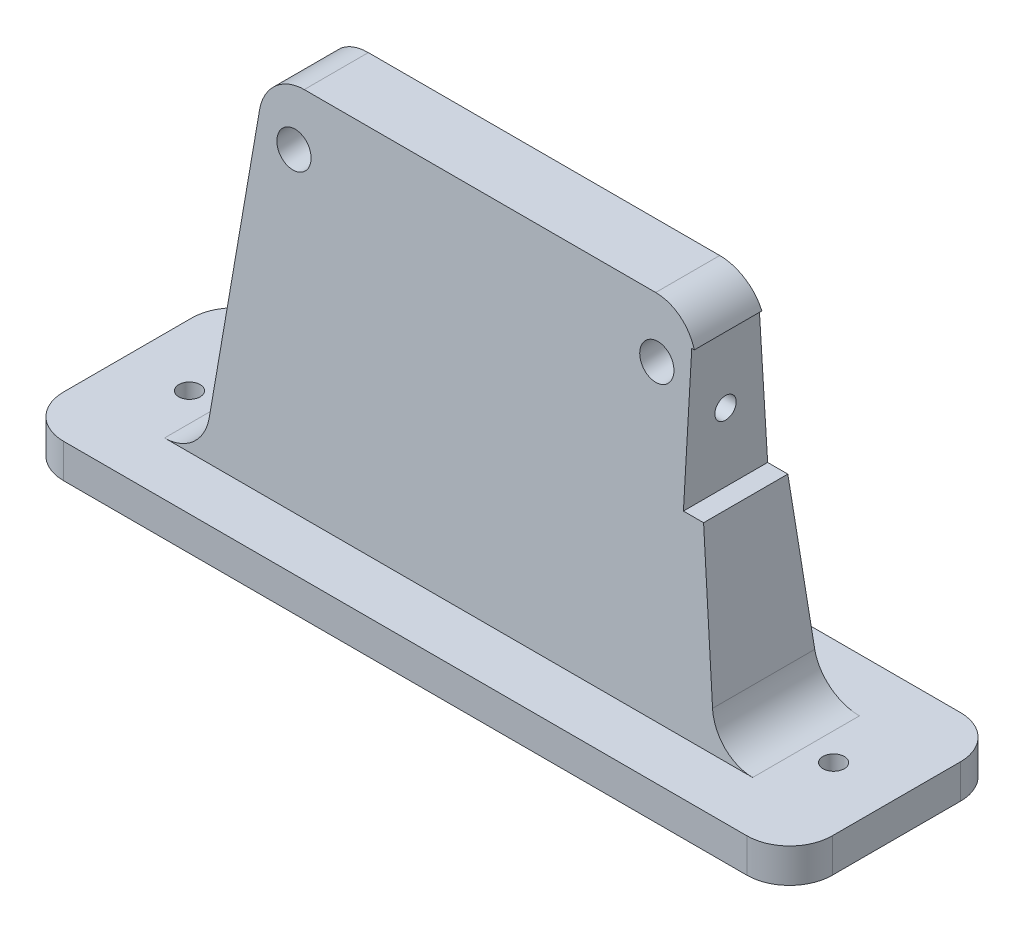
ISO-10303-21;
HEADER;
FILE_DESCRIPTION(('STEP AP214'),'2;1');
FILE_NAME('part.step','',(''),(''),'','','');
FILE_SCHEMA(('AUTOMOTIVE_DESIGN { 1 0 10303 214 1 1 1 1 }'));
ENDSEC;
DATA;
#1=APPLICATION_CONTEXT('core data for automotive mechanical design processes');
#2=APPLICATION_PROTOCOL_DEFINITION('international standard','automotive_design',2000,#1);
#3=PRODUCT_CONTEXT('',#1,'mechanical');
#4=PRODUCT('Part','Part','',(#3));
#5=PRODUCT_RELATED_PRODUCT_CATEGORY('part','',(#4));
#6=PRODUCT_DEFINITION_FORMATION('','',#4);
#7=PRODUCT_DEFINITION_CONTEXT('part definition',#1,'design');
#8=PRODUCT_DEFINITION('design','',#6,#7);
#9=PRODUCT_DEFINITION_SHAPE('','',#8);
#10=(LENGTH_UNIT() NAMED_UNIT(*) SI_UNIT(.MILLI.,.METRE.));
#11=(NAMED_UNIT(*) PLANE_ANGLE_UNIT() SI_UNIT($,.RADIAN.));
#12=(NAMED_UNIT(*) SI_UNIT($,.STERADIAN.) SOLID_ANGLE_UNIT());
#13=UNCERTAINTY_MEASURE_WITH_UNIT(LENGTH_MEASURE(1.E-05),#10,'distance_accuracy_value','');
#14=(GEOMETRIC_REPRESENTATION_CONTEXT(3) GLOBAL_UNCERTAINTY_ASSIGNED_CONTEXT((#13)) GLOBAL_UNIT_ASSIGNED_CONTEXT((#10,
#11,#12)) REPRESENTATION_CONTEXT('',''));
#15=CARTESIAN_POINT('',(0.,0.,0.));
#16=DIRECTION('',(0.,0.,1.));
#17=DIRECTION('',(1.,0.,0.));
#18=AXIS2_PLACEMENT_3D('',#15,#16,#17);
#19=CARTESIAN_POINT('',(-68.854573867348,18.,0.));
#20=DIRECTION('',(0.,0.,-1.));
#21=DIRECTION('',(-1.,0.,0.));
#22=AXIS2_PLACEMENT_3D('',#19,#20,#21);
#23=CYLINDRICAL_SURFACE('',#22,10.);
#24=DIRECTION('',(0.,0.,1.));
#25=VECTOR('',#24,1.);
#26=CARTESIAN_POINT('',(-58.9281150918427,16.7894562468896,0.));
#27=LINE('',#26,#25);
#28=CARTESIAN_POINT('',(-58.9281150918427,16.7894562468896,-11.9640575459214));
#29=VERTEX_POINT('',#28);
#30=CARTESIAN_POINT('',(-58.9281150918427,16.7894562468896,11.9640575459214));
#31=VERTEX_POINT('',#30);
#32=EDGE_CURVE('E361',#29,#31,#27,.T.);
#33=ORIENTED_EDGE('',*,*,#32,.F.);
#34=CARTESIAN_POINT('',(-68.854573867348,18.,-11.890243902439));
#35=DIRECTION('',(0.,-0.0608625704505583,0.998146155389155));
#36=DIRECTION('',(0.,-0.998146155389155,-0.0608625704505583));
#37=AXIS2_PLACEMENT_3D('',#34,#35,#36);
#38=ELLIPSE('',#37,10.018572877337,10.);
#39=CARTESIAN_POINT('',(-68.854573867348,8.,-12.5));
#40=VERTEX_POINT('',#39);
#41=EDGE_CURVE('E60',#29,#40,#38,.F.);
#42=ORIENTED_EDGE('',*,*,#41,.T.);
#43=DIRECTION('',(0.,0.,1.));
#44=VECTOR('',#43,1.);
#45=CARTESIAN_POINT('',(-68.854573867348,8.,0.));
#46=LINE('',#45,#44);
#47=CARTESIAN_POINT('',(-68.854573867348,8.,12.5));
#48=VERTEX_POINT('',#47);
#49=EDGE_CURVE('E498',#48,#40,#46,.F.);
#50=ORIENTED_EDGE('',*,*,#49,.F.);
#51=CARTESIAN_POINT('',(-68.854573867348,18.,11.890243902439));
#52=DIRECTION('',(0.,-0.0608625704505584,-0.998146155389155));
#53=DIRECTION('',(0.,0.998146155389155,-0.0608625704505584));
#54=AXIS2_PLACEMENT_3D('',#51,#52,#53);
#55=ELLIPSE('',#54,10.018572877337,10.);
#56=EDGE_CURVE('E12',#48,#31,#55,.F.);
#57=ORIENTED_EDGE('',*,*,#56,.T.);
#58=EDGE_LOOP('',(#33,#42,#50,#57));
#59=FACE_BOUND('',#58,.T.);
#60=ADVANCED_FACE('F52',(#59),#23,.F.);
#61=CARTESIAN_POINT('',(68.854573867348,18.,0.));
#62=DIRECTION('',(0.,0.,1.));
#63=DIRECTION('',(1.,0.,0.));
#64=AXIS2_PLACEMENT_3D('',#61,#62,#63);
#65=CYLINDRICAL_SURFACE('',#64,10.);
#66=DIRECTION('',(0.,0.,-1.));
#67=VECTOR('',#66,1.);
#68=CARTESIAN_POINT('',(58.9281150918427,16.7894562468896,0.));
#69=LINE('',#68,#67);
#70=CARTESIAN_POINT('',(58.9281150918427,16.7894562468896,11.9640575459214));
#71=VERTEX_POINT('',#70);
#72=CARTESIAN_POINT('',(58.9281150918427,16.7894562468896,-11.9640575459214));
#73=VERTEX_POINT('',#72);
#74=EDGE_CURVE('E215',#71,#73,#69,.T.);
#75=ORIENTED_EDGE('',*,*,#74,.F.);
#76=CARTESIAN_POINT('',(68.854573867348,18.,11.890243902439));
#77=DIRECTION('',(0.,-0.0608625704505584,-0.998146155389155));
#78=DIRECTION('',(0.,-0.998146155389155,0.0608625704505584));
#79=AXIS2_PLACEMENT_3D('',#76,#77,#78);
#80=ELLIPSE('',#79,10.018572877337,10.);
#81=CARTESIAN_POINT('',(68.854573867348,8.,12.5));
#82=VERTEX_POINT('',#81);
#83=EDGE_CURVE('E354',#71,#82,#80,.F.);
#84=ORIENTED_EDGE('',*,*,#83,.T.);
#85=DIRECTION('',(0.,0.,-1.));
#86=VECTOR('',#85,1.);
#87=CARTESIAN_POINT('',(68.854573867348,8.,0.));
#88=LINE('',#87,#86);
#89=CARTESIAN_POINT('',(68.854573867348,8.,-12.5));
#90=VERTEX_POINT('',#89);
#91=EDGE_CURVE('E351',#90,#82,#88,.F.);
#92=ORIENTED_EDGE('',*,*,#91,.F.);
#93=CARTESIAN_POINT('',(68.854573867348,18.,-11.890243902439));
#94=DIRECTION('',(0.,-0.0608625704505583,0.998146155389155));
#95=DIRECTION('',(0.,0.998146155389155,0.0608625704505583));
#96=AXIS2_PLACEMENT_3D('',#93,#94,#95);
#97=ELLIPSE('',#96,10.018572877337,10.);
#98=EDGE_CURVE('E358',#90,#73,#97,.F.);
#99=ORIENTED_EDGE('',*,*,#98,.T.);
#100=EDGE_LOOP('',(#75,#84,#92,#99));
#101=FACE_BOUND('',#100,.T.);
#102=ADVANCED_FACE('F569',(#101),#65,.F.);
#103=CARTESIAN_POINT('',(60.0820633059789,7.32708089097302,0.));
#104=DIRECTION('',(-0.992645877550526,-0.121054375311039,0.));
#105=DIRECTION('',(0.121054375311039,-0.992645877550526,0.));
#106=AXIS2_PLACEMENT_3D('',#103,#104,#105);
#107=PLANE('',#106);
#108=DIRECTION('',(-0.120833238932402,0.990832559245699,-0.0604166194662013));
#109=VECTOR('',#108,1.);
#110=CARTESIAN_POINT('',(60.,8.,12.5));
#111=LINE('',#110,#109);
#112=CARTESIAN_POINT('',(54.7219524509109,51.2799899025308,9.86097622545543));
#113=VERTEX_POINT('',#112);
#114=EDGE_CURVE('E227',#71,#113,#111,.T.);
#115=ORIENTED_EDGE('',*,*,#114,.F.);
#116=ORIENTED_EDGE('',*,*,#74,.T.);
#117=DIRECTION('',(-0.120833238932402,0.990832559245699,0.0604166194662011));
#118=VECTOR('',#117,1.);
#119=CARTESIAN_POINT('',(60.,8.,-12.5));
#120=LINE('',#119,#118);
#121=CARTESIAN_POINT('',(54.7219524509109,51.2799899025308,-9.86097622545545));
#122=VERTEX_POINT('',#121);
#123=EDGE_CURVE('E343',#73,#122,#120,.T.);
#124=ORIENTED_EDGE('',*,*,#123,.T.);
#125=DIRECTION('',(0.,0.,-1.));
#126=VECTOR('',#125,1.);
#127=CARTESIAN_POINT('',(54.7219524509109,51.2799899025308,0.));
#128=LINE('',#127,#126);
#129=EDGE_CURVE('E468',#113,#122,#128,.T.);
#130=ORIENTED_EDGE('',*,*,#129,.F.);
#131=EDGE_LOOP('',(#115,#116,#124,#130));
#132=FACE_BOUND('',#131,.T.);
#133=ADVANCED_FACE('F389',(#132),#107,.F.);
#134=CARTESIAN_POINT('',(41.145426132652,80.,0.));
#135=DIRECTION('',(0.,0.,-1.));
#136=DIRECTION('',(-1.,0.,0.));
#137=AXIS2_PLACEMENT_3D('',#134,#135,#136);
#138=CYLINDRICAL_SURFACE('',#137,10.);
#139=CARTESIAN_POINT('',(41.145426132652,80.,8.10975609756097));
#140=DIRECTION('',(0.,-0.0608625704505584,-0.998146155389155));
#141=DIRECTION('',(0.,0.998146155389155,-0.0608625704505584));
#142=AXIS2_PLACEMENT_3D('',#139,#140,#141);
#143=ELLIPSE('',#142,10.018572877337,10.);
#144=CARTESIAN_POINT('',(50.5921998549606,83.2800100974692,7.90975548186163));
#145=VERTEX_POINT('',#144);
#146=CARTESIAN_POINT('',(41.145426132652,90.,7.49999999999999));
#147=VERTEX_POINT('',#146);
#148=EDGE_CURVE('E222',#145,#147,#143,.F.);
#149=ORIENTED_EDGE('',*,*,#148,.F.);
#150=DIRECTION('',(0.,0.,-1.));
#151=VECTOR('',#150,1.);
#152=CARTESIAN_POINT('',(50.5921998549606,83.2800100974692,0.));
#153=LINE('',#152,#151);
#154=CARTESIAN_POINT('',(50.5921998549606,83.2800100974692,-7.90975548186164));
#155=VERTEX_POINT('',#154);
#156=EDGE_CURVE('E463',#145,#155,#153,.T.);
#157=ORIENTED_EDGE('',*,*,#156,.T.);
#158=CARTESIAN_POINT('',(41.145426132652,80.,-8.10975609756098));
#159=DIRECTION('',(0.,-0.0608625704505583,0.998146155389155));
#160=DIRECTION('',(0.,-0.998146155389155,-0.0608625704505583));
#161=AXIS2_PLACEMENT_3D('',#158,#159,#160);
#162=ELLIPSE('',#161,10.018572877337,10.);
#163=CARTESIAN_POINT('',(41.145426132652,90.,-7.50000000000001));
#164=VERTEX_POINT('',#163);
#165=EDGE_CURVE('E208',#164,#155,#162,.F.);
#166=ORIENTED_EDGE('',*,*,#165,.F.);
#167=DIRECTION('',(0.,0.,-1.));
#168=VECTOR('',#167,1.);
#169=CARTESIAN_POINT('',(41.145426132652,90.,0.));
#170=LINE('',#169,#168);
#171=EDGE_CURVE('E226',#147,#164,#170,.T.);
#172=ORIENTED_EDGE('',*,*,#171,.F.);
#173=EDGE_LOOP('',(#149,#157,#166,#172));
#174=FACE_BOUND('',#173,.T.);
#175=ADVANCED_FACE('F462',(#174),#138,.T.);
#176=CARTESIAN_POINT('',(0.,0.789005778633874,12.9396947695955));
#177=DIRECTION('',(0.,-0.0608625704505584,-0.998146155389155));
#178=DIRECTION('',(0.,0.998146155389155,-0.0608625704505584));
#179=AXIS2_PLACEMENT_3D('',#176,#177,#178);
#180=PLANE('',#179);
#181=CARTESIAN_POINT('',(42.2141626200467,76.8616492298102,8.30111894940183));
#182=DIRECTION('',(0.,-0.0608625704505584,-0.998146155389155));
#183=DIRECTION('',(0.,0.998146155389155,-0.0608625704505584));
#184=AXIS2_PLACEMENT_3D('',#181,#182,#183);
#185=ELLIPSE('',#184,4.029855202269,4.00000000000001);
#186=CARTESIAN_POINT('',(42.2141626200467,80.88403370673,8.05585160324818));
#187=VERTEX_POINT('',#186);
#188=EDGE_CURVE('E335',#187,#187,#185,.T.);
#189=ORIENTED_EDGE('',*,*,#188,.T.);
#190=EDGE_LOOP('',(#189));
#191=FACE_BOUND('',#190,.T.);
#192=CARTESIAN_POINT('',(-42.7841008219345,77.4080238027561,8.26780342666122));
#193=DIRECTION('',(0.,-0.0608625704505584,-0.998146155389155));
#194=DIRECTION('',(0.,0.998146155389155,-0.0608625704505584));
#195=AXIS2_PLACEMENT_3D('',#192,#193,#194);
#196=ELLIPSE('',#195,4.029855202269,4.00000000000001);
#197=CARTESIAN_POINT('',(-42.7841008219345,81.4304082796759,8.02253608050758));
#198=VERTEX_POINT('',#197);
#199=EDGE_CURVE('E327',#198,#198,#196,.T.);
#200=ORIENTED_EDGE('',*,*,#199,.T.);
#201=EDGE_LOOP('',(#200));
#202=FACE_BOUND('',#201,.T.);
#203=DIRECTION('',(1.,0.,0.));
#204=VECTOR('',#203,1.);
#205=CARTESIAN_POINT('',(0.,51.2799899025308,9.86097622545545));
#206=LINE('',#205,#204);
#207=CARTESIAN_POINT('',(50.,51.2799899025308,9.86097622545544));
#208=VERTEX_POINT('',#207);
#209=EDGE_CURVE('E475',#208,#113,#206,.T.);
#210=ORIENTED_EDGE('',*,*,#209,.F.);
#211=DIRECTION('',(0.,0.998146155389155,-0.0608625704505584));
#212=VECTOR('',#211,1.);
#213=CARTESIAN_POINT('',(50.,0.789005778633874,12.9396947695955));
#214=LINE('',#213,#212);
#215=CARTESIAN_POINT('',(50.,83.2800100974692,7.90975548186163));
#216=VERTEX_POINT('',#215);
#217=EDGE_CURVE('E194',#208,#216,#214,.T.);
#218=ORIENTED_EDGE('',*,*,#217,.T.);
#219=DIRECTION('',(-1.,0.,0.));
#220=VECTOR('',#219,1.);
#221=CARTESIAN_POINT('',(0.,83.2800100974692,7.90975548186163));
#222=LINE('',#221,#220);
#223=EDGE_CURVE('E202',#145,#216,#222,.T.);
#224=ORIENTED_EDGE('',*,*,#223,.F.);
#225=ORIENTED_EDGE('',*,*,#148,.T.);
#226=DIRECTION('',(1.,0.,0.));
#227=VECTOR('',#226,1.);
#228=CARTESIAN_POINT('',(50.,90.,7.49999999999999));
#229=LINE('',#228,#227);
#230=CARTESIAN_POINT('',(-41.145426132652,90.,7.50000000000001));
#231=VERTEX_POINT('',#230);
#232=EDGE_CURVE('E424',#231,#147,#229,.T.);
#233=ORIENTED_EDGE('',*,*,#232,.F.);
#234=CARTESIAN_POINT('',(-41.145426132652,80.,8.10975609756098));
#235=DIRECTION('',(0.,-0.0608625704505584,-0.998146155389155));
#236=DIRECTION('',(0.,-0.998146155389155,0.0608625704505584));
#237=AXIS2_PLACEMENT_3D('',#234,#235,#236);
#238=ELLIPSE('',#237,10.018572877337,10.);
#239=CARTESIAN_POINT('',(-51.0718849081573,81.2105437531104,8.03594245407864));
#240=VERTEX_POINT('',#239);
#241=EDGE_CURVE('E444',#231,#240,#238,.F.);
#242=ORIENTED_EDGE('',*,*,#241,.T.);
#243=DIRECTION('',(0.120833238932402,0.990832559245699,-0.0604166194662011));
#244=VECTOR('',#243,1.);
#245=CARTESIAN_POINT('',(-60.,8.,12.5));
#246=LINE('',#245,#244);
#247=EDGE_CURVE('E347',#31,#240,#246,.T.);
#248=ORIENTED_EDGE('',*,*,#247,.F.);
#249=ORIENTED_EDGE('',*,*,#56,.F.);
#250=DIRECTION('',(1.,0.,0.));
#251=VECTOR('',#250,1.);
#252=CARTESIAN_POINT('',(60.,8.,12.5));
#253=LINE('',#252,#251);
#254=EDGE_CURVE('E75',#48,#82,#253,.T.);
#255=ORIENTED_EDGE('',*,*,#254,.T.);
#256=ORIENTED_EDGE('',*,*,#83,.F.);
#257=ORIENTED_EDGE('',*,*,#114,.T.);
#258=EDGE_LOOP('',(#210,#218,#224,#225,#233,#242,#248,#249,#255,#256,#257));
#259=FACE_BOUND('',#258,.T.);
#260=ADVANCED_FACE('F387',(#191,#202,#259),#180,.F.);
#261=CARTESIAN_POINT('',(0.,0.789005778633874,-12.9396947695955));
#262=DIRECTION('',(0.,-0.0608625704505583,0.998146155389155));
#263=DIRECTION('',(0.,-0.998146155389155,-0.0608625704505583));
#264=AXIS2_PLACEMENT_3D('',#261,#262,#263);
#265=PLANE('',#264);
#266=CARTESIAN_POINT('',(42.2141626200467,77.8702308772408,-8.23962006846094));
#267=DIRECTION('',(0.,0.0608625704505583,-0.998146155389155));
#268=DIRECTION('',(0.,0.998146155389155,0.0608625704505583));
#269=AXIS2_PLACEMENT_3D('',#266,#267,#268);
#270=CIRCLE('',#269,4.00000000000001);
#271=CARTESIAN_POINT('',(42.2141626200467,81.8628154987975,-7.9961697866587));
#272=VERTEX_POINT('',#271);
#273=EDGE_CURVE('E331',#272,#272,#270,.T.);
#274=ORIENTED_EDGE('',*,*,#273,.F.);
#275=EDGE_LOOP('',(#274));
#276=FACE_BOUND('',#275,.T.);
#277=CARTESIAN_POINT('',(-42.7841008219345,78.412557631451,-8.20655136393591));
#278=DIRECTION('',(0.,0.0608625704505583,-0.998146155389155));
#279=DIRECTION('',(0.,0.998146155389155,0.0608625704505583));
#280=AXIS2_PLACEMENT_3D('',#277,#278,#279);
#281=CIRCLE('',#280,4.00000000000001);
#282=CARTESIAN_POINT('',(-42.7841008219345,82.4051422530076,-7.96310108213368));
#283=VERTEX_POINT('',#282);
#284=EDGE_CURVE('E323',#283,#283,#281,.T.);
#285=ORIENTED_EDGE('',*,*,#284,.F.);
#286=EDGE_LOOP('',(#285));
#287=FACE_BOUND('',#286,.T.);
#288=DIRECTION('',(-1.,0.,0.));
#289=VECTOR('',#288,1.);
#290=CARTESIAN_POINT('',(0.,51.2799899025308,-9.86097622545545));
#291=LINE('',#290,#289);
#292=CARTESIAN_POINT('',(50.,51.2799899025308,-9.86097622545545));
#293=VERTEX_POINT('',#292);
#294=EDGE_CURVE('E210',#122,#293,#291,.T.);
#295=ORIENTED_EDGE('',*,*,#294,.F.);
#296=ORIENTED_EDGE('',*,*,#123,.F.);
#297=ORIENTED_EDGE('',*,*,#98,.F.);
#298=DIRECTION('',(-1.,0.,0.));
#299=VECTOR('',#298,1.);
#300=CARTESIAN_POINT('',(60.,8.,-12.5));
#301=LINE('',#300,#299);
#302=EDGE_CURVE('E67',#90,#40,#301,.T.);
#303=ORIENTED_EDGE('',*,*,#302,.T.);
#304=ORIENTED_EDGE('',*,*,#41,.F.);
#305=DIRECTION('',(0.120833238932402,0.990832559245699,0.0604166194662012));
#306=VECTOR('',#305,1.);
#307=CARTESIAN_POINT('',(-60.,8.,-12.5));
#308=LINE('',#307,#306);
#309=CARTESIAN_POINT('',(-51.0718849081573,81.2105437531104,-8.03594245407863));
#310=VERTEX_POINT('',#309);
#311=EDGE_CURVE('E346',#29,#310,#308,.T.);
#312=ORIENTED_EDGE('',*,*,#311,.T.);
#313=CARTESIAN_POINT('',(-41.145426132652,80.,-8.10975609756097));
#314=DIRECTION('',(0.,-0.0608625704505583,0.998146155389155));
#315=DIRECTION('',(0.,0.998146155389155,0.0608625704505583));
#316=AXIS2_PLACEMENT_3D('',#313,#314,#315);
#317=ELLIPSE('',#316,10.018572877337,10.);
#318=CARTESIAN_POINT('',(-41.145426132652,90.,-7.5));
#319=VERTEX_POINT('',#318);
#320=EDGE_CURVE('E440',#310,#319,#317,.F.);
#321=ORIENTED_EDGE('',*,*,#320,.T.);
#322=DIRECTION('',(-1.,0.,0.));
#323=VECTOR('',#322,1.);
#324=CARTESIAN_POINT('',(50.,90.,-7.50000000000001));
#325=LINE('',#324,#323);
#326=EDGE_CURVE('E451',#164,#319,#325,.T.);
#327=ORIENTED_EDGE('',*,*,#326,.F.);
#328=ORIENTED_EDGE('',*,*,#165,.T.);
#329=DIRECTION('',(1.,0.,0.));
#330=VECTOR('',#329,1.);
#331=CARTESIAN_POINT('',(0.,83.2800100974692,-7.90975548186163));
#332=LINE('',#331,#330);
#333=CARTESIAN_POINT('',(50.,83.2800100974692,-7.90975548186164));
#334=VERTEX_POINT('',#333);
#335=EDGE_CURVE('E199',#334,#155,#332,.T.);
#336=ORIENTED_EDGE('',*,*,#335,.F.);
#337=DIRECTION('',(0.,-0.998146155389155,-0.0608625704505583));
#338=VECTOR('',#337,1.);
#339=CARTESIAN_POINT('',(50.,0.789005778633874,-12.9396947695955));
#340=LINE('',#339,#338);
#341=EDGE_CURVE('E183',#334,#293,#340,.T.);
#342=ORIENTED_EDGE('',*,*,#341,.T.);
#343=EDGE_LOOP('',(#295,#296,#297,#303,#304,#312,#321,#327,#328,#336,#342));
#344=FACE_BOUND('',#343,.T.);
#345=ADVANCED_FACE('F206',(#276,#287,#344),#265,.F.);
#346=CARTESIAN_POINT('',(80.,8.,-15.));
#347=DIRECTION('',(0.,1.,0.));
#348=DIRECTION('',(0.,0.,1.));
#349=AXIS2_PLACEMENT_3D('',#346,#347,#348);
#350=CYLINDRICAL_SURFACE('',#349,10.);
#351=DIRECTION('',(0.,-1.,0.));
#352=VECTOR('',#351,1.);
#353=CARTESIAN_POINT('',(80.,8.,-25.));
#354=LINE('',#353,#352);
#355=CARTESIAN_POINT('',(80.,8.,-25.));
#356=VERTEX_POINT('',#355);
#357=CARTESIAN_POINT('',(80.,0.,-25.));
#358=VERTEX_POINT('',#357);
#359=EDGE_CURVE('E284',#356,#358,#354,.T.);
#360=ORIENTED_EDGE('',*,*,#359,.F.);
#361=CARTESIAN_POINT('',(80.,8.,-15.));
#362=DIRECTION('',(0.,-1.,0.));
#363=DIRECTION('',(0.,0.,-1.));
#364=AXIS2_PLACEMENT_3D('',#361,#362,#363);
#365=CIRCLE('',#364,10.);
#366=CARTESIAN_POINT('',(90.,8.,-15.));
#367=VERTEX_POINT('',#366);
#368=EDGE_CURVE('E217',#367,#356,#365,.F.);
#369=ORIENTED_EDGE('',*,*,#368,.F.);
#370=DIRECTION('',(0.,-1.,0.));
#371=VECTOR('',#370,1.);
#372=CARTESIAN_POINT('',(90.,8.,-15.));
#373=LINE('',#372,#371);
#374=CARTESIAN_POINT('',(90.,0.,-15.));
#375=VERTEX_POINT('',#374);
#376=EDGE_CURVE('E288',#375,#367,#373,.F.);
#377=ORIENTED_EDGE('',*,*,#376,.F.);
#378=CARTESIAN_POINT('',(80.,0.,-15.));
#379=DIRECTION('',(0.,-1.,0.));
#380=DIRECTION('',(0.,0.,-1.));
#381=AXIS2_PLACEMENT_3D('',#378,#379,#380);
#382=CIRCLE('',#381,10.);
#383=EDGE_CURVE('E211',#358,#375,#382,.T.);
#384=ORIENTED_EDGE('',*,*,#383,.F.);
#385=EDGE_LOOP('',(#360,#369,#377,#384));
#386=FACE_BOUND('',#385,.T.);
#387=ADVANCED_FACE('F386',(#386),#350,.T.);
#388=CARTESIAN_POINT('',(80.,0.,15.));
#389=DIRECTION('',(0.,1.,0.));
#390=DIRECTION('',(0.,0.,1.));
#391=AXIS2_PLACEMENT_3D('',#388,#389,#390);
#392=CYLINDRICAL_SURFACE('',#391,10.);
#393=DIRECTION('',(0.,-1.,0.));
#394=VECTOR('',#393,1.);
#395=CARTESIAN_POINT('',(90.,0.,15.));
#396=LINE('',#395,#394);
#397=CARTESIAN_POINT('',(90.,8.,15.));
#398=VERTEX_POINT('',#397);
#399=CARTESIAN_POINT('',(90.,0.,15.));
#400=VERTEX_POINT('',#399);
#401=EDGE_CURVE('E269',#398,#400,#396,.T.);
#402=ORIENTED_EDGE('',*,*,#401,.F.);
#403=CARTESIAN_POINT('',(80.,8.,15.));
#404=DIRECTION('',(0.,-1.,0.));
#405=DIRECTION('',(0.,0.,-1.));
#406=AXIS2_PLACEMENT_3D('',#403,#404,#405);
#407=CIRCLE('',#406,10.);
#408=CARTESIAN_POINT('',(80.,8.,25.));
#409=VERTEX_POINT('',#408);
#410=EDGE_CURVE('E277',#409,#398,#407,.F.);
#411=ORIENTED_EDGE('',*,*,#410,.F.);
#412=DIRECTION('',(0.,-1.,0.));
#413=VECTOR('',#412,1.);
#414=CARTESIAN_POINT('',(80.,0.,25.));
#415=LINE('',#414,#413);
#416=CARTESIAN_POINT('',(80.,0.,25.));
#417=VERTEX_POINT('',#416);
#418=EDGE_CURVE('E273',#417,#409,#415,.F.);
#419=ORIENTED_EDGE('',*,*,#418,.F.);
#420=CARTESIAN_POINT('',(80.,0.,15.));
#421=DIRECTION('',(0.,-1.,0.));
#422=DIRECTION('',(0.,0.,-1.));
#423=AXIS2_PLACEMENT_3D('',#420,#421,#422);
#424=CIRCLE('',#423,10.);
#425=EDGE_CURVE('E281',#400,#417,#424,.T.);
#426=ORIENTED_EDGE('',*,*,#425,.F.);
#427=EDGE_LOOP('',(#402,#411,#419,#426));
#428=FACE_BOUND('',#427,.T.);
#429=ADVANCED_FACE('F542',(#428),#392,.T.);
#430=CARTESIAN_POINT('',(-80.,8.,15.));
#431=DIRECTION('',(0.,1.,0.));
#432=DIRECTION('',(0.,0.,1.));
#433=AXIS2_PLACEMENT_3D('',#430,#431,#432);
#434=CYLINDRICAL_SURFACE('',#433,10.);
#435=DIRECTION('',(0.,-1.,0.));
#436=VECTOR('',#435,1.);
#437=CARTESIAN_POINT('',(-80.,8.,25.));
#438=LINE('',#437,#436);
#439=CARTESIAN_POINT('',(-80.,8.,25.));
#440=VERTEX_POINT('',#439);
#441=CARTESIAN_POINT('',(-80.,0.,25.));
#442=VERTEX_POINT('',#441);
#443=EDGE_CURVE('E255',#440,#442,#438,.T.);
#444=ORIENTED_EDGE('',*,*,#443,.F.);
#445=CARTESIAN_POINT('',(-80.,8.,15.));
#446=DIRECTION('',(0.,-1.,0.));
#447=DIRECTION('',(0.,0.,-1.));
#448=AXIS2_PLACEMENT_3D('',#445,#446,#447);
#449=CIRCLE('',#448,10.);
#450=CARTESIAN_POINT('',(-90.,8.,15.));
#451=VERTEX_POINT('',#450);
#452=EDGE_CURVE('E263',#451,#440,#449,.F.);
#453=ORIENTED_EDGE('',*,*,#452,.F.);
#454=DIRECTION('',(0.,-1.,0.));
#455=VECTOR('',#454,1.);
#456=CARTESIAN_POINT('',(-90.,8.,15.));
#457=LINE('',#456,#455);
#458=CARTESIAN_POINT('',(-90.,0.,15.));
#459=VERTEX_POINT('',#458);
#460=EDGE_CURVE('E259',#459,#451,#457,.F.);
#461=ORIENTED_EDGE('',*,*,#460,.F.);
#462=CARTESIAN_POINT('',(-80.,0.,15.));
#463=DIRECTION('',(0.,-1.,0.));
#464=DIRECTION('',(0.,0.,-1.));
#465=AXIS2_PLACEMENT_3D('',#462,#463,#464);
#466=CIRCLE('',#465,10.);
#467=EDGE_CURVE('E266',#442,#459,#466,.T.);
#468=ORIENTED_EDGE('',*,*,#467,.F.);
#469=EDGE_LOOP('',(#444,#453,#461,#468));
#470=FACE_BOUND('',#469,.T.);
#471=ADVANCED_FACE('F559',(#470),#434,.T.);
#472=CARTESIAN_POINT('',(-80.,8.,-15.));
#473=DIRECTION('',(0.,-1.,0.));
#474=DIRECTION('',(0.,0.,-1.));
#475=AXIS2_PLACEMENT_3D('',#472,#473,#474);
#476=CYLINDRICAL_SURFACE('',#475,10.);
#477=DIRECTION('',(0.,1.,0.));
#478=VECTOR('',#477,1.);
#479=CARTESIAN_POINT('',(-80.,8.,-25.));
#480=LINE('',#479,#478);
#481=CARTESIAN_POINT('',(-80.,0.,-25.));
#482=VERTEX_POINT('',#481);
#483=CARTESIAN_POINT('',(-80.,8.,-25.));
#484=VERTEX_POINT('',#483);
#485=EDGE_CURVE('E237',#482,#484,#480,.T.);
#486=ORIENTED_EDGE('',*,*,#485,.F.);
#487=CARTESIAN_POINT('',(-80.,0.,-15.));
#488=DIRECTION('',(0.,-1.,0.));
#489=DIRECTION('',(0.,0.,-1.));
#490=AXIS2_PLACEMENT_3D('',#487,#488,#489);
#491=CIRCLE('',#490,10.);
#492=CARTESIAN_POINT('',(-90.,0.,-15.));
#493=VERTEX_POINT('',#492);
#494=EDGE_CURVE('E247',#493,#482,#491,.T.);
#495=ORIENTED_EDGE('',*,*,#494,.F.);
#496=DIRECTION('',(0.,1.,0.));
#497=VECTOR('',#496,1.);
#498=CARTESIAN_POINT('',(-90.,8.,-15.));
#499=LINE('',#498,#497);
#500=CARTESIAN_POINT('',(-90.,8.,-15.));
#501=VERTEX_POINT('',#500);
#502=EDGE_CURVE('E243',#501,#493,#499,.F.);
#503=ORIENTED_EDGE('',*,*,#502,.F.);
#504=CARTESIAN_POINT('',(-80.,8.,-15.));
#505=DIRECTION('',(0.,-1.,0.));
#506=DIRECTION('',(0.,0.,-1.));
#507=AXIS2_PLACEMENT_3D('',#504,#505,#506);
#508=CIRCLE('',#507,10.);
#509=EDGE_CURVE('E251',#484,#501,#508,.F.);
#510=ORIENTED_EDGE('',*,*,#509,.F.);
#511=EDGE_LOOP('',(#486,#495,#503,#510));
#512=FACE_BOUND('',#511,.T.);
#513=ADVANCED_FACE('F552',(#512),#476,.T.);
#514=CARTESIAN_POINT('',(-41.145426132652,80.,0.));
#515=DIRECTION('',(0.,0.,1.));
#516=DIRECTION('',(1.,0.,0.));
#517=AXIS2_PLACEMENT_3D('',#514,#515,#516);
#518=CYLINDRICAL_SURFACE('',#517,10.);
#519=DIRECTION('',(0.,0.,1.));
#520=VECTOR('',#519,1.);
#521=CARTESIAN_POINT('',(-41.145426132652,90.,0.));
#522=LINE('',#521,#520);
#523=EDGE_CURVE('E430',#319,#231,#522,.T.);
#524=ORIENTED_EDGE('',*,*,#523,.F.);
#525=ORIENTED_EDGE('',*,*,#320,.F.);
#526=DIRECTION('',(0.,0.,1.));
#527=VECTOR('',#526,1.);
#528=CARTESIAN_POINT('',(-51.0718849081573,81.2105437531104,0.));
#529=LINE('',#528,#527);
#530=EDGE_CURVE('E433',#240,#310,#529,.F.);
#531=ORIENTED_EDGE('',*,*,#530,.F.);
#532=ORIENTED_EDGE('',*,*,#241,.F.);
#533=EDGE_LOOP('',(#524,#525,#531,#532));
#534=FACE_BOUND('',#533,.T.);
#535=ADVANCED_FACE('F514',(#534),#518,.T.);
#536=CARTESIAN_POINT('',(60.,8.,25.));
#537=DIRECTION('',(0.,0.,-1.));
#538=DIRECTION('',(-1.,0.,0.));
#539=AXIS2_PLACEMENT_3D('',#536,#537,#538);
#540=PLANE('',#539);
#541=DIRECTION('',(1.,0.,0.));
#542=VECTOR('',#541,1.);
#543=CARTESIAN_POINT('',(60.,0.,25.));
#544=LINE('',#543,#542);
#545=EDGE_CURVE('E455',#442,#417,#544,.T.);
#546=ORIENTED_EDGE('',*,*,#545,.T.);
#547=ORIENTED_EDGE('',*,*,#418,.T.);
#548=DIRECTION('',(1.,0.,0.));
#549=VECTOR('',#548,1.);
#550=CARTESIAN_POINT('',(60.,8.,25.));
#551=LINE('',#550,#549);
#552=EDGE_CURVE('E410',#440,#409,#551,.T.);
#553=ORIENTED_EDGE('',*,*,#552,.F.);
#554=ORIENTED_EDGE('',*,*,#443,.T.);
#555=EDGE_LOOP('',(#546,#547,#553,#554));
#556=FACE_BOUND('',#555,.T.);
#557=ADVANCED_FACE('F538',(#556),#540,.F.);
#558=CARTESIAN_POINT('',(60.,8.,-25.));
#559=DIRECTION('',(0.,0.,1.));
#560=DIRECTION('',(1.,0.,0.));
#561=AXIS2_PLACEMENT_3D('',#558,#559,#560);
#562=PLANE('',#561);
#563=DIRECTION('',(-1.,0.,0.));
#564=VECTOR('',#563,1.);
#565=CARTESIAN_POINT('',(60.,8.,-25.));
#566=LINE('',#565,#564);
#567=EDGE_CURVE('E434',#356,#484,#566,.T.);
#568=ORIENTED_EDGE('',*,*,#567,.F.);
#569=ORIENTED_EDGE('',*,*,#359,.T.);
#570=DIRECTION('',(-1.,0.,0.));
#571=VECTOR('',#570,1.);
#572=CARTESIAN_POINT('',(60.,0.,-25.));
#573=LINE('',#572,#571);
#574=EDGE_CURVE('E522',#358,#482,#573,.T.);
#575=ORIENTED_EDGE('',*,*,#574,.T.);
#576=ORIENTED_EDGE('',*,*,#485,.T.);
#577=EDGE_LOOP('',(#568,#569,#575,#576));
#578=FACE_BOUND('',#577,.T.);
#579=ADVANCED_FACE('F494',(#578),#562,.F.);
#580=CARTESIAN_POINT('',(0.,8.,0.));
#581=DIRECTION('',(0.,-1.,0.));
#582=DIRECTION('',(0.,0.,-1.));
#583=AXIS2_PLACEMENT_3D('',#580,#581,#582);
#584=PLANE('',#583);
#585=CARTESIAN_POINT('',(75.3070966373184,8.,0.));
#586=DIRECTION('',(0.,1.,0.));
#587=DIRECTION('',(0.,0.,1.));
#588=AXIS2_PLACEMENT_3D('',#585,#586,#587);
#589=CIRCLE('',#588,2.5);
#590=CARTESIAN_POINT('',(75.3070966373184,8.,2.5));
#591=VERTEX_POINT('',#590);
#592=EDGE_CURVE('E298',#591,#591,#589,.T.);
#593=ORIENTED_EDGE('',*,*,#592,.F.);
#594=EDGE_LOOP('',(#593));
#595=FACE_BOUND('',#594,.T.);
#596=CARTESIAN_POINT('',(-75.5234963402992,8.,0.));
#597=DIRECTION('',(0.,1.,0.));
#598=DIRECTION('',(0.,0.,1.));
#599=AXIS2_PLACEMENT_3D('',#596,#597,#598);
#600=CIRCLE('',#599,2.5);
#601=CARTESIAN_POINT('',(-75.5234963402992,8.,2.5));
#602=VERTEX_POINT('',#601);
#603=EDGE_CURVE('E314',#602,#602,#600,.T.);
#604=ORIENTED_EDGE('',*,*,#603,.F.);
#605=EDGE_LOOP('',(#604));
#606=FACE_BOUND('',#605,.T.);
#607=DIRECTION('',(0.,0.,1.));
#608=VECTOR('',#607,1.);
#609=CARTESIAN_POINT('',(90.,8.,25.));
#610=LINE('',#609,#608);
#611=EDGE_CURVE('E306',#367,#398,#610,.T.);
#612=ORIENTED_EDGE('',*,*,#611,.F.);
#613=ORIENTED_EDGE('',*,*,#368,.T.);
#614=ORIENTED_EDGE('',*,*,#567,.T.);
#615=ORIENTED_EDGE('',*,*,#509,.T.);
#616=DIRECTION('',(0.,0.,-1.));
#617=VECTOR('',#616,1.);
#618=CARTESIAN_POINT('',(-90.,8.,-25.));
#619=LINE('',#618,#617);
#620=EDGE_CURVE('E320',#451,#501,#619,.T.);
#621=ORIENTED_EDGE('',*,*,#620,.F.);
#622=ORIENTED_EDGE('',*,*,#452,.T.);
#623=ORIENTED_EDGE('',*,*,#552,.T.);
#624=ORIENTED_EDGE('',*,*,#410,.T.);
#625=EDGE_LOOP('',(#612,#613,#614,#615,#621,#622,#623,#624));
#626=FACE_BOUND('',#625,.T.);
#627=ORIENTED_EDGE('',*,*,#49,.T.);
#628=ORIENTED_EDGE('',*,*,#302,.F.);
#629=ORIENTED_EDGE('',*,*,#91,.T.);
#630=ORIENTED_EDGE('',*,*,#254,.F.);
#631=EDGE_LOOP('',(#627,#628,#629,#630));
#632=FACE_BOUND('',#631,.T.);
#633=ADVANCED_FACE('F398',(#595,#606,#626,#632),#584,.F.);
#634=CARTESIAN_POINT('',(0.,0.,0.));
#635=DIRECTION('',(0.,-1.,0.));
#636=DIRECTION('',(0.,0.,-1.));
#637=AXIS2_PLACEMENT_3D('',#634,#635,#636);
#638=PLANE('',#637);
#639=CARTESIAN_POINT('',(75.3070966373184,0.,0.));
#640=DIRECTION('',(0.,-1.,0.));
#641=DIRECTION('',(0.,0.,-1.));
#642=AXIS2_PLACEMENT_3D('',#639,#640,#641);
#643=CIRCLE('',#642,2.5);
#644=CARTESIAN_POINT('',(75.3070966373184,0.,-2.5));
#645=VERTEX_POINT('',#644);
#646=EDGE_CURVE('E297',#645,#645,#643,.T.);
#647=ORIENTED_EDGE('',*,*,#646,.F.);
#648=EDGE_LOOP('',(#647));
#649=FACE_BOUND('',#648,.T.);
#650=CARTESIAN_POINT('',(-75.5234963402992,0.,0.));
#651=DIRECTION('',(0.,-1.,0.));
#652=DIRECTION('',(0.,0.,-1.));
#653=AXIS2_PLACEMENT_3D('',#650,#651,#652);
#654=CIRCLE('',#653,2.5);
#655=CARTESIAN_POINT('',(-75.5234963402992,0.,-2.5));
#656=VERTEX_POINT('',#655);
#657=EDGE_CURVE('E294',#656,#656,#654,.T.);
#658=ORIENTED_EDGE('',*,*,#657,.F.);
#659=EDGE_LOOP('',(#658));
#660=FACE_BOUND('',#659,.T.);
#661=ORIENTED_EDGE('',*,*,#574,.F.);
#662=ORIENTED_EDGE('',*,*,#383,.T.);
#663=DIRECTION('',(0.,0.,-1.));
#664=VECTOR('',#663,1.);
#665=CARTESIAN_POINT('',(90.,0.,25.));
#666=LINE('',#665,#664);
#667=EDGE_CURVE('E301',#400,#375,#666,.T.);
#668=ORIENTED_EDGE('',*,*,#667,.F.);
#669=ORIENTED_EDGE('',*,*,#425,.T.);
#670=ORIENTED_EDGE('',*,*,#545,.F.);
#671=ORIENTED_EDGE('',*,*,#467,.T.);
#672=DIRECTION('',(0.,0.,1.));
#673=VECTOR('',#672,1.);
#674=CARTESIAN_POINT('',(-90.,0.,-25.));
#675=LINE('',#674,#673);
#676=EDGE_CURVE('E311',#493,#459,#675,.T.);
#677=ORIENTED_EDGE('',*,*,#676,.F.);
#678=ORIENTED_EDGE('',*,*,#494,.T.);
#679=EDGE_LOOP('',(#661,#662,#668,#669,#670,#671,#677,#678));
#680=FACE_BOUND('',#679,.T.);
#681=ADVANCED_FACE('F396',(#649,#660,#680),#638,.T.);
#682=CARTESIAN_POINT('',(0.,90.,0.));
#683=DIRECTION('',(0.,-1.,0.));
#684=DIRECTION('',(0.,0.,-1.));
#685=AXIS2_PLACEMENT_3D('',#682,#683,#684);
#686=PLANE('',#685);
#687=ORIENTED_EDGE('',*,*,#232,.T.);
#688=ORIENTED_EDGE('',*,*,#171,.T.);
#689=ORIENTED_EDGE('',*,*,#326,.T.);
#690=ORIENTED_EDGE('',*,*,#523,.T.);
#691=EDGE_LOOP('',(#687,#688,#689,#690));
#692=FACE_BOUND('',#691,.T.);
#693=ADVANCED_FACE('F391',(#692),#686,.F.);
#694=CARTESIAN_POINT('',(-60.0820633059789,7.32708089097304,0.));
#695=DIRECTION('',(0.992645877550526,-0.12105437531104,0.));
#696=DIRECTION('',(0.12105437531104,0.992645877550526,0.));
#697=AXIS2_PLACEMENT_3D('',#694,#695,#696);
#698=PLANE('',#697);
#699=ORIENTED_EDGE('',*,*,#311,.F.);
#700=ORIENTED_EDGE('',*,*,#32,.T.);
#701=ORIENTED_EDGE('',*,*,#247,.T.);
#702=ORIENTED_EDGE('',*,*,#530,.T.);
#703=EDGE_LOOP('',(#699,#700,#701,#702));
#704=FACE_BOUND('',#703,.T.);
#705=ADVANCED_FACE('F395',(#704),#698,.F.);
#706=CARTESIAN_POINT('',(42.2141626200467,72.8795001002951,73.6083646734498));
#707=DIRECTION('',(0.,0.0608625704505583,-0.998146155389155));
#708=DIRECTION('',(0.,0.998146155389155,0.0608625704505583));
#709=AXIS2_PLACEMENT_3D('',#706,#707,#708);
#710=CYLINDRICAL_SURFACE('',#709,4.00000000000001);
#711=ORIENTED_EDGE('',*,*,#273,.T.);
#712=EDGE_LOOP('',(#711));
#713=FACE_BOUND('',#712,.T.);
#714=ORIENTED_EDGE('',*,*,#188,.F.);
#715=EDGE_LOOP('',(#714));
#716=FACE_BOUND('',#715,.T.);
#717=ADVANCED_FACE('F646',(#713,#716),#710,.F.);
#718=CARTESIAN_POINT('',(-42.7841008219345,73.4218268545052,73.6414333779748));
#719=DIRECTION('',(0.,0.0608625704505583,-0.998146155389155));
#720=DIRECTION('',(0.,0.998146155389155,0.0608625704505583));
#721=AXIS2_PLACEMENT_3D('',#718,#719,#720);
#722=CYLINDRICAL_SURFACE('',#721,4.00000000000001);
#723=ORIENTED_EDGE('',*,*,#284,.T.);
#724=EDGE_LOOP('',(#723));
#725=FACE_BOUND('',#724,.T.);
#726=ORIENTED_EDGE('',*,*,#199,.F.);
#727=EDGE_LOOP('',(#726));
#728=FACE_BOUND('',#727,.T.);
#729=ADVANCED_FACE('F655',(#725,#728),#722,.F.);
#730=CARTESIAN_POINT('',(-90.,0.,0.));
#731=DIRECTION('',(-1.,0.,0.));
#732=DIRECTION('',(0.,0.,1.));
#733=AXIS2_PLACEMENT_3D('',#730,#731,#732);
#734=PLANE('',#733);
#735=ORIENTED_EDGE('',*,*,#676,.T.);
#736=ORIENTED_EDGE('',*,*,#460,.T.);
#737=ORIENTED_EDGE('',*,*,#620,.T.);
#738=ORIENTED_EDGE('',*,*,#502,.T.);
#739=EDGE_LOOP('',(#735,#736,#737,#738));
#740=FACE_BOUND('',#739,.T.);
#741=ADVANCED_FACE('F555',(#740),#734,.T.);
#742=CARTESIAN_POINT('',(90.,0.,0.));
#743=DIRECTION('',(1.,0.,0.));
#744=DIRECTION('',(0.,0.,-1.));
#745=AXIS2_PLACEMENT_3D('',#742,#743,#744);
#746=PLANE('',#745);
#747=ORIENTED_EDGE('',*,*,#667,.T.);
#748=ORIENTED_EDGE('',*,*,#376,.T.);
#749=ORIENTED_EDGE('',*,*,#611,.T.);
#750=ORIENTED_EDGE('',*,*,#401,.T.);
#751=EDGE_LOOP('',(#747,#748,#749,#750));
#752=FACE_BOUND('',#751,.T.);
#753=ADVANCED_FACE('F543',(#752),#746,.T.);
#754=CARTESIAN_POINT('',(-75.5234963402992,-2.,0.));
#755=DIRECTION('',(0.,1.,0.));
#756=DIRECTION('',(0.,0.,1.));
#757=AXIS2_PLACEMENT_3D('',#754,#755,#756);
#758=CYLINDRICAL_SURFACE('',#757,2.5);
#759=ORIENTED_EDGE('',*,*,#657,.T.);
#760=EDGE_LOOP('',(#759));
#761=FACE_BOUND('',#760,.T.);
#762=ORIENTED_EDGE('',*,*,#603,.T.);
#763=EDGE_LOOP('',(#762));
#764=FACE_BOUND('',#763,.T.);
#765=ADVANCED_FACE('F490',(#761,#764),#758,.F.);
#766=CARTESIAN_POINT('',(75.3070966373184,-2.,0.));
#767=DIRECTION('',(0.,1.,0.));
#768=DIRECTION('',(0.,0.,1.));
#769=AXIS2_PLACEMENT_3D('',#766,#767,#768);
#770=CYLINDRICAL_SURFACE('',#769,2.5);
#771=ORIENTED_EDGE('',*,*,#646,.T.);
#772=EDGE_LOOP('',(#771));
#773=FACE_BOUND('',#772,.T.);
#774=ORIENTED_EDGE('',*,*,#592,.T.);
#775=EDGE_LOOP('',(#774));
#776=FACE_BOUND('',#775,.T.);
#777=ADVANCED_FACE('F674',(#773,#776),#770,.F.);
#778=CARTESIAN_POINT('',(55.,51.2799899025308,-10.3086193750702));
#779=DIRECTION('',(0.,1.,0.));
#780=DIRECTION('',(0.,0.,1.));
#781=AXIS2_PLACEMENT_3D('',#778,#779,#780);
#782=PLANE('',#781);
#783=ORIENTED_EDGE('',*,*,#209,.T.);
#784=ORIENTED_EDGE('',*,*,#129,.T.);
#785=ORIENTED_EDGE('',*,*,#294,.T.);
#786=DIRECTION('',(0.,0.,-1.));
#787=VECTOR('',#786,1.);
#788=CARTESIAN_POINT('',(50.,51.2799899025308,-10.3086193750702));
#789=LINE('',#788,#787);
#790=EDGE_CURVE('E189',#208,#293,#789,.T.);
#791=ORIENTED_EDGE('',*,*,#790,.F.);
#792=EDGE_LOOP('',(#783,#784,#785,#791));
#793=FACE_BOUND('',#792,.T.);
#794=ADVANCED_FACE('F682',(#793),#782,.T.);
#795=CARTESIAN_POINT('',(55.,83.2800100974692,-10.3086193750702));
#796=DIRECTION('',(0.,-1.,0.));
#797=DIRECTION('',(0.,0.,-1.));
#798=AXIS2_PLACEMENT_3D('',#795,#796,#797);
#799=PLANE('',#798);
#800=ORIENTED_EDGE('',*,*,#223,.T.);
#801=DIRECTION('',(0.,0.,1.));
#802=VECTOR('',#801,1.);
#803=CARTESIAN_POINT('',(50.,83.2800100974692,-10.3086193750702));
#804=LINE('',#803,#802);
#805=EDGE_CURVE('E186',#334,#216,#804,.T.);
#806=ORIENTED_EDGE('',*,*,#805,.F.);
#807=ORIENTED_EDGE('',*,*,#335,.T.);
#808=ORIENTED_EDGE('',*,*,#156,.F.);
#809=EDGE_LOOP('',(#800,#806,#807,#808));
#810=FACE_BOUND('',#809,.T.);
#811=ADVANCED_FACE('F198',(#810),#799,.T.);
#812=CARTESIAN_POINT('',(50.,0.,0.));
#813=DIRECTION('',(-1.,0.,0.));
#814=DIRECTION('',(0.,0.,1.));
#815=AXIS2_PLACEMENT_3D('',#812,#813,#814);
#816=PLANE('',#815);
#817=CARTESIAN_POINT('',(50.,67.28,0.));
#818=DIRECTION('',(-1.,0.,0.));
#819=DIRECTION('',(0.,0.,1.));
#820=AXIS2_PLACEMENT_3D('',#817,#818,#819);
#821=CIRCLE('',#820,2.5);
#822=CARTESIAN_POINT('',(50.,67.28,2.5));
#823=VERTEX_POINT('',#822);
#824=EDGE_CURVE('E195',#823,#823,#821,.T.);
#825=ORIENTED_EDGE('',*,*,#824,.T.);
#826=EDGE_LOOP('',(#825));
#827=FACE_BOUND('',#826,.T.);
#828=ORIENTED_EDGE('',*,*,#790,.T.);
#829=ORIENTED_EDGE('',*,*,#341,.F.);
#830=ORIENTED_EDGE('',*,*,#805,.T.);
#831=ORIENTED_EDGE('',*,*,#217,.F.);
#832=EDGE_LOOP('',(#828,#829,#830,#831));
#833=FACE_BOUND('',#832,.T.);
#834=ADVANCED_FACE('F185',(#827,#833),#816,.F.);
#835=CARTESIAN_POINT('',(40.,67.28,0.));
#836=DIRECTION('',(1.,0.,0.));
#837=DIRECTION('',(0.,0.,-1.));
#838=AXIS2_PLACEMENT_3D('',#835,#836,#837);
#839=PLANE('',#838);
#840=CARTESIAN_POINT('',(40.,67.28,0.));
#841=DIRECTION('',(1.,0.,0.));
#842=DIRECTION('',(0.,0.,-1.));
#843=AXIS2_PLACEMENT_3D('',#840,#841,#842);
#844=CIRCLE('',#843,2.5);
#845=CARTESIAN_POINT('',(40.,67.28,-2.5));
#846=VERTEX_POINT('',#845);
#847=EDGE_CURVE('E479',#846,#846,#844,.T.);
#848=ORIENTED_EDGE('',*,*,#847,.T.);
#849=EDGE_LOOP('',(#848));
#850=FACE_BOUND('',#849,.T.);
#851=ADVANCED_FACE('F704',(#850),#839,.T.);
#852=CARTESIAN_POINT('',(56.,67.28,0.));
#853=DIRECTION('',(-1.,0.,0.));
#854=DIRECTION('',(0.,0.,1.));
#855=AXIS2_PLACEMENT_3D('',#852,#853,#854);
#856=CYLINDRICAL_SURFACE('',#855,2.5);
#857=ORIENTED_EDGE('',*,*,#824,.F.);
#858=EDGE_LOOP('',(#857));
#859=FACE_BOUND('',#858,.T.);
#860=ORIENTED_EDGE('',*,*,#847,.F.);
#861=EDGE_LOOP('',(#860));
#862=FACE_BOUND('',#861,.T.);
#863=ADVANCED_FACE('F711',(#859,#862),#856,.F.);
#864=CLOSED_SHELL('',(#60,#102,#133,#175,#260,#345,#387,#429,#471,#513,#535,#557,#579,#633,#681,
#693,#705,#717,#729,#741,#753,#765,#777,#794,#811,#834,#851,#863));
#865=MANIFOLD_SOLID_BREP('B2',#864);
#866=ADVANCED_BREP_SHAPE_REPRESENTATION('',(#18,#865),#14);
#867=SHAPE_DEFINITION_REPRESENTATION(#9,#866);
ENDSEC;
END-ISO-10303-21;
